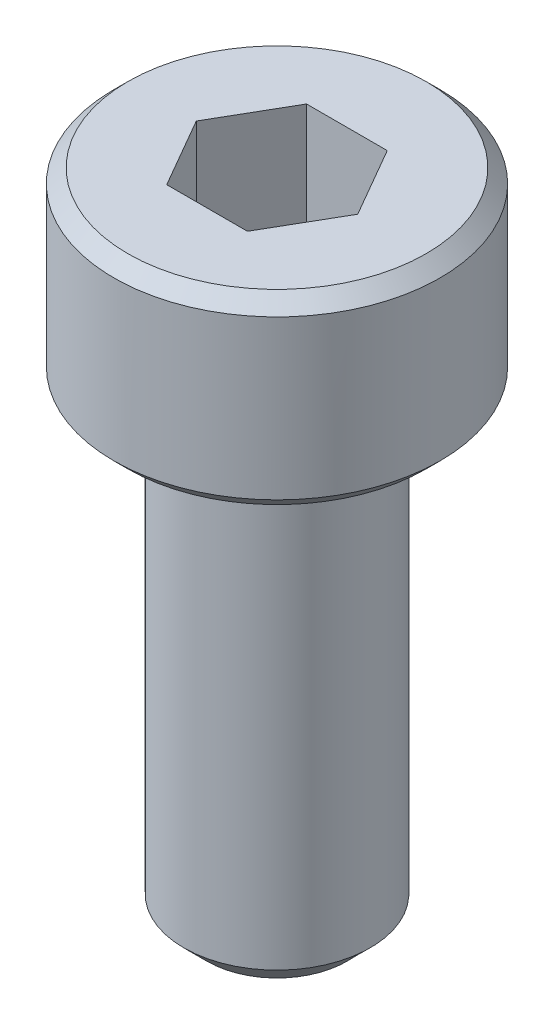
ISO-10303-21;
HEADER;
FILE_DESCRIPTION(('STEP AP214'),'2;1');
FILE_NAME('part.step','',(''),(''),'','','');
FILE_SCHEMA(('AUTOMOTIVE_DESIGN { 1 0 10303 214 1 1 1 1 }'));
ENDSEC;
DATA;
#1=APPLICATION_CONTEXT('core data for automotive mechanical design processes');
#2=APPLICATION_PROTOCOL_DEFINITION('international standard','automotive_design',2000,#1);
#3=PRODUCT_CONTEXT('',#1,'mechanical');
#4=PRODUCT('Part','Part','',(#3));
#5=PRODUCT_RELATED_PRODUCT_CATEGORY('part','',(#4));
#6=PRODUCT_DEFINITION_FORMATION('','',#4);
#7=PRODUCT_DEFINITION_CONTEXT('part definition',#1,'design');
#8=PRODUCT_DEFINITION('design','',#6,#7);
#9=PRODUCT_DEFINITION_SHAPE('','',#8);
#10=(LENGTH_UNIT() NAMED_UNIT(*) SI_UNIT(.MILLI.,.METRE.));
#11=(NAMED_UNIT(*) PLANE_ANGLE_UNIT() SI_UNIT($,.RADIAN.));
#12=(NAMED_UNIT(*) SI_UNIT($,.STERADIAN.) SOLID_ANGLE_UNIT());
#13=UNCERTAINTY_MEASURE_WITH_UNIT(LENGTH_MEASURE(1.E-05),#10,'distance_accuracy_value','');
#14=(GEOMETRIC_REPRESENTATION_CONTEXT(3) GLOBAL_UNCERTAINTY_ASSIGNED_CONTEXT((#13)) GLOBAL_UNIT_ASSIGNED_CONTEXT((#10,
#11,#12)) REPRESENTATION_CONTEXT('',''));
#15=CARTESIAN_POINT('',(0.,0.,0.));
#16=DIRECTION('',(0.,0.,1.));
#17=DIRECTION('',(1.,0.,0.));
#18=AXIS2_PLACEMENT_3D('',#15,#16,#17);
#19=CARTESIAN_POINT('',(0.866025403784439,11.,1.5));
#20=DIRECTION('',(0.866025403784439,0.,0.5));
#21=DIRECTION('',(0.5,0.,-0.866025403784439));
#22=AXIS2_PLACEMENT_3D('',#19,#20,#21);
#23=PLANE('',#22);
#24=DIRECTION('',(0.5,0.,-0.866025403784439));
#25=VECTOR('',#24,1.);
#26=CARTESIAN_POINT('',(0.866025403784439,11.,1.5));
#27=LINE('',#26,#25);
#28=CARTESIAN_POINT('',(0.866025403784439,11.,1.5));
#29=VERTEX_POINT('',#28);
#30=CARTESIAN_POINT('',(1.73205080756888,11.,0.));
#31=VERTEX_POINT('',#30);
#32=EDGE_CURVE('E65',#29,#31,#27,.T.);
#33=ORIENTED_EDGE('',*,*,#32,.F.);
#34=DIRECTION('',(0.,1.,0.));
#35=VECTOR('',#34,1.);
#36=CARTESIAN_POINT('',(0.866025403784439,11.,1.5));
#37=LINE('',#36,#35);
#38=CARTESIAN_POINT('',(0.866025403784439,14.,1.5));
#39=VERTEX_POINT('',#38);
#40=EDGE_CURVE('E84',#29,#39,#37,.T.);
#41=ORIENTED_EDGE('',*,*,#40,.T.);
#42=DIRECTION('',(0.5,0.,-0.866025403784439));
#43=VECTOR('',#42,1.);
#44=CARTESIAN_POINT('',(0.866025403784439,14.,1.5));
#45=LINE('',#44,#43);
#46=CARTESIAN_POINT('',(1.73205080756888,14.,0.));
#47=VERTEX_POINT('',#46);
#48=EDGE_CURVE('E72',#47,#39,#45,.F.);
#49=ORIENTED_EDGE('',*,*,#48,.F.);
#50=DIRECTION('',(0.,1.,0.));
#51=VECTOR('',#50,1.);
#52=CARTESIAN_POINT('',(1.73205080756888,11.,0.));
#53=LINE('',#52,#51);
#54=EDGE_CURVE('E79',#47,#31,#53,.F.);
#55=ORIENTED_EDGE('',*,*,#54,.T.);
#56=EDGE_LOOP('',(#33,#41,#49,#55));
#57=FACE_BOUND('',#56,.T.);
#58=ADVANCED_FACE('F16',(#57),#23,.F.);
#59=CARTESIAN_POINT('',(1.73205080756888,11.,0.));
#60=DIRECTION('',(0.866025403784438,0.,-0.5));
#61=DIRECTION('',(-0.5,0.,-0.866025403784438));
#62=AXIS2_PLACEMENT_3D('',#59,#60,#61);
#63=PLANE('',#62);
#64=DIRECTION('',(-0.5,0.,-0.866025403784438));
#65=VECTOR('',#64,1.);
#66=CARTESIAN_POINT('',(1.73205080756888,11.,0.));
#67=LINE('',#66,#65);
#68=CARTESIAN_POINT('',(0.866025403784438,11.,-1.5));
#69=VERTEX_POINT('',#68);
#70=EDGE_CURVE('E88',#31,#69,#67,.T.);
#71=ORIENTED_EDGE('',*,*,#70,.F.);
#72=ORIENTED_EDGE('',*,*,#54,.F.);
#73=DIRECTION('',(-0.5,0.,-0.866025403784438));
#74=VECTOR('',#73,1.);
#75=CARTESIAN_POINT('',(1.73205080756888,14.,0.));
#76=LINE('',#75,#74);
#77=CARTESIAN_POINT('',(0.866025403784439,14.,-1.5));
#78=VERTEX_POINT('',#77);
#79=EDGE_CURVE('E69',#78,#47,#76,.F.);
#80=ORIENTED_EDGE('',*,*,#79,.F.);
#81=DIRECTION('',(0.,1.,0.));
#82=VECTOR('',#81,1.);
#83=CARTESIAN_POINT('',(0.866025403784438,11.,-1.5));
#84=LINE('',#83,#82);
#85=EDGE_CURVE('E132',#78,#69,#84,.F.);
#86=ORIENTED_EDGE('',*,*,#85,.T.);
#87=EDGE_LOOP('',(#71,#72,#80,#86));
#88=FACE_BOUND('',#87,.T.);
#89=ADVANCED_FACE('F87',(#88),#63,.F.);
#90=CARTESIAN_POINT('',(-0.866025403784438,11.,1.5));
#91=DIRECTION('',(0.,0.,1.));
#92=DIRECTION('',(1.,0.,0.));
#93=AXIS2_PLACEMENT_3D('',#90,#91,#92);
#94=PLANE('',#93);
#95=DIRECTION('',(1.,0.,0.));
#96=VECTOR('',#95,1.);
#97=CARTESIAN_POINT('',(1.73205080756888,11.,1.5));
#98=LINE('',#97,#96);
#99=CARTESIAN_POINT('',(-0.866025403784438,11.,1.5));
#100=VERTEX_POINT('',#99);
#101=EDGE_CURVE('E130',#100,#29,#98,.T.);
#102=ORIENTED_EDGE('',*,*,#101,.F.);
#103=DIRECTION('',(0.,1.,0.));
#104=VECTOR('',#103,1.);
#105=CARTESIAN_POINT('',(-0.866025403784438,11.,1.5));
#106=LINE('',#105,#104);
#107=CARTESIAN_POINT('',(-0.866025403784438,14.,1.5));
#108=VERTEX_POINT('',#107);
#109=EDGE_CURVE('E120',#100,#108,#106,.T.);
#110=ORIENTED_EDGE('',*,*,#109,.T.);
#111=DIRECTION('',(1.,0.,0.));
#112=VECTOR('',#111,1.);
#113=CARTESIAN_POINT('',(-0.866025403784438,14.,1.5));
#114=LINE('',#113,#112);
#115=EDGE_CURVE('E90',#39,#108,#114,.F.);
#116=ORIENTED_EDGE('',*,*,#115,.F.);
#117=ORIENTED_EDGE('',*,*,#40,.F.);
#118=EDGE_LOOP('',(#102,#110,#116,#117));
#119=FACE_BOUND('',#118,.T.);
#120=ADVANCED_FACE('F137',(#119),#94,.F.);
#121=CARTESIAN_POINT('',(0.866025403784438,11.,-1.5));
#122=DIRECTION('',(0.,0.,-1.));
#123=DIRECTION('',(-1.,0.,0.));
#124=AXIS2_PLACEMENT_3D('',#121,#122,#123);
#125=PLANE('',#124);
#126=DIRECTION('',(1.,0.,0.));
#127=VECTOR('',#126,1.);
#128=CARTESIAN_POINT('',(1.73205080756888,11.,-1.5));
#129=LINE('',#128,#127);
#130=CARTESIAN_POINT('',(-0.866025403784438,11.,-1.5));
#131=VERTEX_POINT('',#130);
#132=EDGE_CURVE('E127',#69,#131,#129,.F.);
#133=ORIENTED_EDGE('',*,*,#132,.F.);
#134=ORIENTED_EDGE('',*,*,#85,.F.);
#135=DIRECTION('',(-1.,0.,0.));
#136=VECTOR('',#135,1.);
#137=CARTESIAN_POINT('',(0.866025403784438,14.,-1.5));
#138=LINE('',#137,#136);
#139=CARTESIAN_POINT('',(-0.866025403784438,14.,-1.5));
#140=VERTEX_POINT('',#139);
#141=EDGE_CURVE('E74',#140,#78,#138,.F.);
#142=ORIENTED_EDGE('',*,*,#141,.F.);
#143=DIRECTION('',(0.,1.,0.));
#144=VECTOR('',#143,1.);
#145=CARTESIAN_POINT('',(-0.866025403784438,11.,-1.5));
#146=LINE('',#145,#144);
#147=EDGE_CURVE('E118',#140,#131,#146,.F.);
#148=ORIENTED_EDGE('',*,*,#147,.T.);
#149=EDGE_LOOP('',(#133,#134,#142,#148));
#150=FACE_BOUND('',#149,.T.);
#151=ADVANCED_FACE('F149',(#150),#125,.F.);
#152=CARTESIAN_POINT('',(1.73205080756888,11.,0.));
#153=DIRECTION('',(0.,1.,0.));
#154=DIRECTION('',(0.,0.,1.));
#155=AXIS2_PLACEMENT_3D('',#152,#153,#154);
#156=PLANE('',#155);
#157=ORIENTED_EDGE('',*,*,#132,.T.);
#158=DIRECTION('',(-0.5,0.,0.866025403784439));
#159=VECTOR('',#158,1.);
#160=CARTESIAN_POINT('',(-0.866025403784438,11.,-1.5));
#161=LINE('',#160,#159);
#162=CARTESIAN_POINT('',(-1.73205080756888,11.,0.));
#163=VERTEX_POINT('',#162);
#164=EDGE_CURVE('E116',#131,#163,#161,.T.);
#165=ORIENTED_EDGE('',*,*,#164,.T.);
#166=DIRECTION('',(0.5,0.,0.866025403784439));
#167=VECTOR('',#166,1.);
#168=CARTESIAN_POINT('',(-1.73205080756888,11.,0.));
#169=LINE('',#168,#167);
#170=EDGE_CURVE('E123',#163,#100,#169,.T.);
#171=ORIENTED_EDGE('',*,*,#170,.T.);
#172=ORIENTED_EDGE('',*,*,#101,.T.);
#173=ORIENTED_EDGE('',*,*,#32,.T.);
#174=ORIENTED_EDGE('',*,*,#70,.T.);
#175=EDGE_LOOP('',(#157,#165,#171,#172,#173,#174));
#176=FACE_BOUND('',#175,.T.);
#177=ADVANCED_FACE('F150',(#176),#156,.T.);
#178=CARTESIAN_POINT('',(-1.73205080756888,11.,0.));
#179=DIRECTION('',(-0.866025403784439,0.,0.5));
#180=DIRECTION('',(0.5,0.,0.866025403784439));
#181=AXIS2_PLACEMENT_3D('',#178,#179,#180);
#182=PLANE('',#181);
#183=ORIENTED_EDGE('',*,*,#170,.F.);
#184=DIRECTION('',(0.,1.,0.));
#185=VECTOR('',#184,1.);
#186=CARTESIAN_POINT('',(-1.73205080756888,11.,0.));
#187=LINE('',#186,#185);
#188=CARTESIAN_POINT('',(-1.73205080756888,14.,0.));
#189=VERTEX_POINT('',#188);
#190=EDGE_CURVE('E114',#163,#189,#187,.T.);
#191=ORIENTED_EDGE('',*,*,#190,.T.);
#192=DIRECTION('',(0.5,0.,0.866025403784439));
#193=VECTOR('',#192,1.);
#194=CARTESIAN_POINT('',(-1.73205080756888,14.,0.));
#195=LINE('',#194,#193);
#196=EDGE_CURVE('E34',#108,#189,#195,.F.);
#197=ORIENTED_EDGE('',*,*,#196,.F.);
#198=ORIENTED_EDGE('',*,*,#109,.F.);
#199=EDGE_LOOP('',(#183,#191,#197,#198));
#200=FACE_BOUND('',#199,.T.);
#201=ADVANCED_FACE('F140',(#200),#182,.F.);
#202=CARTESIAN_POINT('',(-0.866025403784438,11.,-1.5));
#203=DIRECTION('',(-0.866025403784439,0.,-0.5));
#204=DIRECTION('',(-0.5,0.,0.866025403784439));
#205=AXIS2_PLACEMENT_3D('',#202,#203,#204);
#206=PLANE('',#205);
#207=ORIENTED_EDGE('',*,*,#164,.F.);
#208=ORIENTED_EDGE('',*,*,#147,.F.);
#209=DIRECTION('',(0.5,0.,-0.866025403784439));
#210=VECTOR('',#209,1.);
#211=CARTESIAN_POINT('',(-1.73205080756888,14.,0.));
#212=LINE('',#211,#210);
#213=EDGE_CURVE('E112',#189,#140,#212,.T.);
#214=ORIENTED_EDGE('',*,*,#213,.F.);
#215=ORIENTED_EDGE('',*,*,#190,.F.);
#216=EDGE_LOOP('',(#207,#208,#214,#215));
#217=FACE_BOUND('',#216,.T.);
#218=ADVANCED_FACE('F146',(#217),#206,.F.);
#219=CARTESIAN_POINT('',(0.,14.,-3.5));
#220=DIRECTION('',(0.,1.,0.));
#221=DIRECTION('',(0.,0.,1.));
#222=AXIS2_PLACEMENT_3D('',#219,#220,#221);
#223=PLANE('',#222);
#224=CARTESIAN_POINT('',(0.,13.9999999999532,0.));
#225=DIRECTION('',(0.,-1.,0.));
#226=DIRECTION('',(0.,0.,-1.));
#227=AXIS2_PLACEMENT_3D('',#224,#225,#226);
#228=CIRCLE('',#227,3.1999999999357);
#229=CARTESIAN_POINT('',(0.,13.9999999999532,-3.1999999999357));
#230=VERTEX_POINT('',#229);
#231=EDGE_CURVE('E19',#230,#230,#228,.T.);
#232=ORIENTED_EDGE('',*,*,#231,.F.);
#233=EDGE_LOOP('',(#232));
#234=FACE_BOUND('',#233,.T.);
#235=ORIENTED_EDGE('',*,*,#196,.T.);
#236=ORIENTED_EDGE('',*,*,#213,.T.);
#237=ORIENTED_EDGE('',*,*,#141,.T.);
#238=ORIENTED_EDGE('',*,*,#79,.T.);
#239=ORIENTED_EDGE('',*,*,#48,.T.);
#240=ORIENTED_EDGE('',*,*,#115,.T.);
#241=EDGE_LOOP('',(#235,#236,#237,#238,#239,#240));
#242=FACE_BOUND('',#241,.T.);
#243=ADVANCED_FACE('F71',(#234,#242),#223,.T.);
#244=CARTESIAN_POINT('',(0.,13.7000000000853,0.));
#245=DIRECTION('',(0.,-1.,0.));
#246=DIRECTION('',(0.,0.,-1.));
#247=AXIS2_PLACEMENT_3D('',#244,#245,#246);
#248=CONICAL_SURFACE('',#247,3.49999999980355,0.785398163397448);
#249=CARTESIAN_POINT('',(0.,13.7,0.));
#250=DIRECTION('',(0.,-1.,0.));
#251=DIRECTION('',(0.,0.,-1.));
#252=AXIS2_PLACEMENT_3D('',#249,#250,#251);
#253=CIRCLE('',#252,3.5);
#254=CARTESIAN_POINT('',(0.,13.7,-3.5));
#255=VERTEX_POINT('',#254);
#256=EDGE_CURVE('E105',#255,#255,#253,.T.);
#257=ORIENTED_EDGE('',*,*,#256,.F.);
#258=EDGE_LOOP('',(#257));
#259=FACE_BOUND('',#258,.T.);
#260=ORIENTED_EDGE('',*,*,#231,.T.);
#261=EDGE_LOOP('',(#260));
#262=FACE_BOUND('',#261,.T.);
#263=ADVANCED_FACE('F185',(#259,#262),#248,.T.);
#264=CARTESIAN_POINT('',(0.,0.,0.));
#265=DIRECTION('',(0.,-1.,0.));
#266=DIRECTION('',(0.,0.,-1.));
#267=AXIS2_PLACEMENT_3D('',#264,#265,#266);
#268=CYLINDRICAL_SURFACE('',#267,3.5);
#269=CARTESIAN_POINT('',(0.,10.2999999999724,0.));
#270=DIRECTION('',(0.,1.,0.));
#271=DIRECTION('',(0.,0.,1.));
#272=AXIS2_PLACEMENT_3D('',#269,#270,#271);
#273=CIRCLE('',#272,3.49999999997408);
#274=CARTESIAN_POINT('',(0.,10.2999999999724,3.49999999997408));
#275=VERTEX_POINT('',#274);
#276=EDGE_CURVE('E101',#275,#275,#273,.F.);
#277=ORIENTED_EDGE('',*,*,#276,.F.);
#278=EDGE_LOOP('',(#277));
#279=FACE_BOUND('',#278,.T.);
#280=ORIENTED_EDGE('',*,*,#256,.T.);
#281=EDGE_LOOP('',(#280));
#282=FACE_BOUND('',#281,.T.);
#283=ADVANCED_FACE('F182',(#279,#282),#268,.T.);
#284=CARTESIAN_POINT('',(0.,10.2999999998588,0.));
#285=DIRECTION('',(0.,1.,0.));
#286=DIRECTION('',(0.,0.,1.));
#287=AXIS2_PLACEMENT_3D('',#284,#285,#286);
#288=CONICAL_SURFACE('',#287,3.49999999986039,0.785398163397448);
#289=ORIENTED_EDGE('',*,*,#276,.T.);
#290=EDGE_LOOP('',(#289));
#291=FACE_BOUND('',#290,.T.);
#292=CARTESIAN_POINT('',(0.,9.99999999999091,0.));
#293=DIRECTION('',(0.,1.,0.));
#294=DIRECTION('',(0.,0.,1.));
#295=AXIS2_PLACEMENT_3D('',#292,#293,#294);
#296=CIRCLE('',#295,3.19999999999254);
#297=CARTESIAN_POINT('',(0.,9.99999999999091,3.19999999999254));
#298=VERTEX_POINT('',#297);
#299=EDGE_CURVE('E99',#298,#298,#296,.F.);
#300=ORIENTED_EDGE('',*,*,#299,.F.);
#301=EDGE_LOOP('',(#300));
#302=FACE_BOUND('',#301,.T.);
#303=ADVANCED_FACE('F178',(#291,#302),#288,.T.);
#304=CARTESIAN_POINT('',(0.,0.,0.));
#305=DIRECTION('',(0.,-1.,0.));
#306=DIRECTION('',(0.,0.,-1.));
#307=AXIS2_PLACEMENT_3D('',#304,#305,#306);
#308=PLANE('',#307);
#309=CARTESIAN_POINT('',(0.,0.,0.));
#310=DIRECTION('',(0.,1.,0.));
#311=DIRECTION('',(0.,0.,1.));
#312=AXIS2_PLACEMENT_3D('',#309,#310,#311);
#313=CIRCLE('',#312,1.50000000002137);
#314=CARTESIAN_POINT('',(0.,0.,1.50000000002137));
#315=VERTEX_POINT('',#314);
#316=EDGE_CURVE('E97',#315,#315,#313,.T.);
#317=ORIENTED_EDGE('',*,*,#316,.F.);
#318=EDGE_LOOP('',(#317));
#319=FACE_BOUND('',#318,.T.);
#320=ADVANCED_FACE('F175',(#319),#308,.T.);
#321=CARTESIAN_POINT('',(0.,10.,-2.));
#322=DIRECTION('',(0.,-1.,0.));
#323=DIRECTION('',(0.,0.,-1.));
#324=AXIS2_PLACEMENT_3D('',#321,#322,#323);
#325=PLANE('',#324);
#326=ORIENTED_EDGE('',*,*,#299,.T.);
#327=EDGE_LOOP('',(#326));
#328=FACE_BOUND('',#327,.T.);
#329=CARTESIAN_POINT('',(0.,10.,0.));
#330=DIRECTION('',(0.,-1.,0.));
#331=DIRECTION('',(0.,0.,-1.));
#332=AXIS2_PLACEMENT_3D('',#329,#330,#331);
#333=CIRCLE('',#332,2.);
#334=CARTESIAN_POINT('',(0.,10.,-2.));
#335=VERTEX_POINT('',#334);
#336=EDGE_CURVE('E25',#335,#335,#333,.T.);
#337=ORIENTED_EDGE('',*,*,#336,.F.);
#338=EDGE_LOOP('',(#337));
#339=FACE_BOUND('',#338,.T.);
#340=ADVANCED_FACE('F168',(#328,#339),#325,.T.);
#341=CARTESIAN_POINT('',(0.,0.499999999988177,0.));
#342=DIRECTION('',(0.,1.,0.));
#343=DIRECTION('',(0.,0.,1.));
#344=AXIS2_PLACEMENT_3D('',#341,#342,#343);
#345=CONICAL_SURFACE('',#344,2.00000000000955,0.785398163397448);
#346=CARTESIAN_POINT('',(0.,0.500000000000002,0.));
#347=DIRECTION('',(0.,-1.,0.));
#348=DIRECTION('',(0.,0.,-1.));
#349=AXIS2_PLACEMENT_3D('',#346,#347,#348);
#350=CIRCLE('',#349,2.);
#351=CARTESIAN_POINT('',(0.,0.500000000000002,-2.));
#352=VERTEX_POINT('',#351);
#353=EDGE_CURVE('E11',#352,#352,#350,.F.);
#354=ORIENTED_EDGE('',*,*,#353,.F.);
#355=EDGE_LOOP('',(#354));
#356=FACE_BOUND('',#355,.T.);
#357=ORIENTED_EDGE('',*,*,#316,.T.);
#358=EDGE_LOOP('',(#357));
#359=FACE_BOUND('',#358,.T.);
#360=ADVANCED_FACE('F162',(#356,#359),#345,.T.);
#361=CARTESIAN_POINT('',(0.,0.,0.));
#362=DIRECTION('',(0.,-1.,0.));
#363=DIRECTION('',(0.,0.,-1.));
#364=AXIS2_PLACEMENT_3D('',#361,#362,#363);
#365=CYLINDRICAL_SURFACE('',#364,2.);
#366=ORIENTED_EDGE('',*,*,#353,.T.);
#367=EDGE_LOOP('',(#366));
#368=FACE_BOUND('',#367,.T.);
#369=ORIENTED_EDGE('',*,*,#336,.T.);
#370=EDGE_LOOP('',(#369));
#371=FACE_BOUND('',#370,.T.);
#372=ADVANCED_FACE('F160',(#368,#371),#365,.T.);
#373=CLOSED_SHELL('',(#58,#89,#120,#151,#177,#201,#218,#243,#263,#283,#303,#320,#340,#360,#372));
#374=MANIFOLD_SOLID_BREP('B1',#373);
#375=ADVANCED_BREP_SHAPE_REPRESENTATION('',(#18,#374),#14);
#376=SHAPE_DEFINITION_REPRESENTATION(#9,#375);
ENDSEC;
END-ISO-10303-21;
